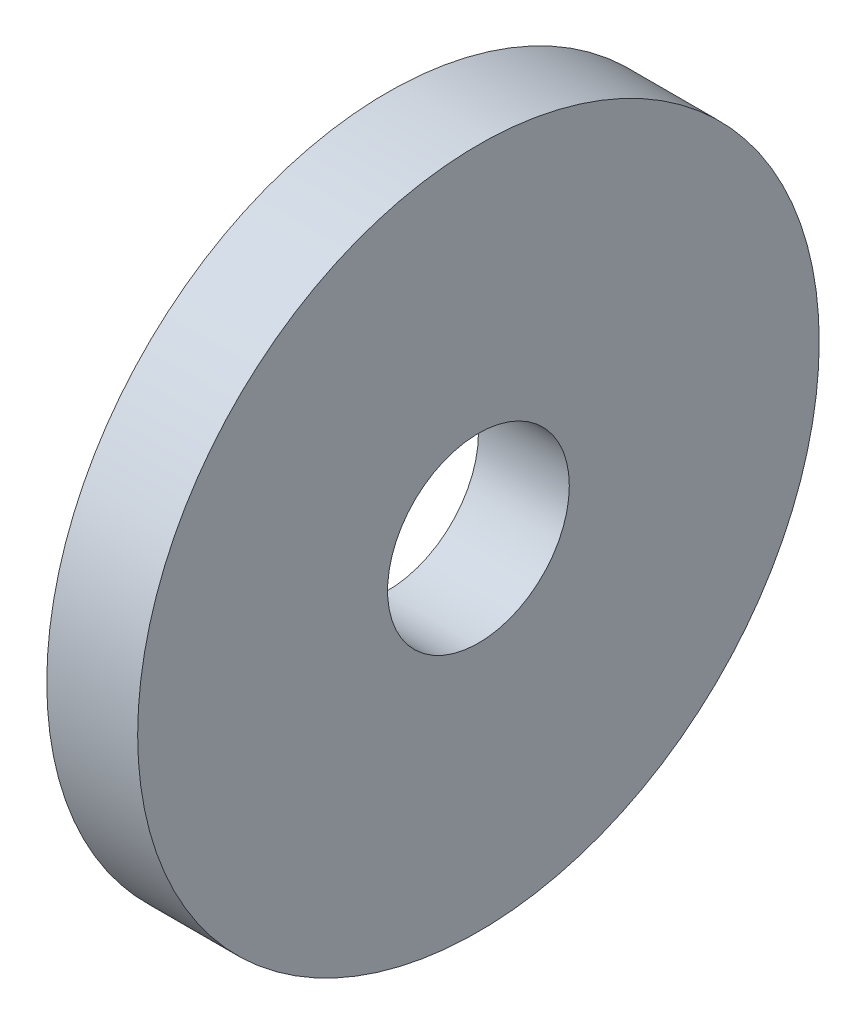
ISO-10303-21;
HEADER;
FILE_DESCRIPTION(('STEP AP214'),'2;1');
FILE_NAME('part.step','',(''),(''),'','','');
FILE_SCHEMA(('AUTOMOTIVE_DESIGN { 1 0 10303 214 1 1 1 1 }'));
ENDSEC;
DATA;
#1=APPLICATION_CONTEXT('core data for automotive mechanical design processes');
#2=APPLICATION_PROTOCOL_DEFINITION('international standard','automotive_design',2000,#1);
#3=PRODUCT_CONTEXT('',#1,'mechanical');
#4=PRODUCT('Part','Part','',(#3));
#5=PRODUCT_RELATED_PRODUCT_CATEGORY('part','',(#4));
#6=PRODUCT_DEFINITION_FORMATION('','',#4);
#7=PRODUCT_DEFINITION_CONTEXT('part definition',#1,'design');
#8=PRODUCT_DEFINITION('design','',#6,#7);
#9=PRODUCT_DEFINITION_SHAPE('','',#8);
#10=(LENGTH_UNIT() NAMED_UNIT(*) SI_UNIT(.MILLI.,.METRE.));
#11=(NAMED_UNIT(*) PLANE_ANGLE_UNIT() SI_UNIT($,.RADIAN.));
#12=(NAMED_UNIT(*) SI_UNIT($,.STERADIAN.) SOLID_ANGLE_UNIT());
#13=UNCERTAINTY_MEASURE_WITH_UNIT(LENGTH_MEASURE(1.E-05),#10,'distance_accuracy_value','');
#14=(GEOMETRIC_REPRESENTATION_CONTEXT(3) GLOBAL_UNCERTAINTY_ASSIGNED_CONTEXT((#13)) GLOBAL_UNIT_ASSIGNED_CONTEXT((#10,
#11,#12)) REPRESENTATION_CONTEXT('',''));
#15=CARTESIAN_POINT('',(0.,0.,0.));
#16=DIRECTION('',(0.,0.,1.));
#17=DIRECTION('',(1.,0.,0.));
#18=AXIS2_PLACEMENT_3D('',#15,#16,#17);
#19=CARTESIAN_POINT('',(2.,0.,0.));
#20=DIRECTION('',(1.,0.,0.));
#21=DIRECTION('',(0.,0.,-1.));
#22=AXIS2_PLACEMENT_3D('',#19,#20,#21);
#23=PLANE('',#22);
#24=CARTESIAN_POINT('',(2.,0.,0.));
#25=DIRECTION('',(1.,0.,0.));
#26=DIRECTION('',(0.,0.,-1.));
#27=AXIS2_PLACEMENT_3D('',#24,#25,#26);
#28=CIRCLE('',#27,7.5);
#29=CARTESIAN_POINT('',(2.,0.,-7.5));
#30=VERTEX_POINT('',#29);
#31=EDGE_CURVE('E10',#30,#30,#28,.T.);
#32=ORIENTED_EDGE('',*,*,#31,.T.);
#33=EDGE_LOOP('',(#32));
#34=FACE_BOUND('',#33,.T.);
#35=CARTESIAN_POINT('',(2.,0.,0.));
#36=DIRECTION('',(1.,0.,0.));
#37=DIRECTION('',(0.,0.,-1.));
#38=AXIS2_PLACEMENT_3D('',#35,#36,#37);
#39=CIRCLE('',#38,2.);
#40=CARTESIAN_POINT('',(2.,0.,-2.));
#41=VERTEX_POINT('',#40);
#42=EDGE_CURVE('E54',#41,#41,#39,.T.);
#43=ORIENTED_EDGE('',*,*,#42,.F.);
#44=EDGE_LOOP('',(#43));
#45=FACE_BOUND('',#44,.T.);
#46=ADVANCED_FACE('F41',(#34,#45),#23,.T.);
#47=CARTESIAN_POINT('',(0.,0.,0.));
#48=DIRECTION('',(1.,0.,0.));
#49=DIRECTION('',(0.,0.,-1.));
#50=AXIS2_PLACEMENT_3D('',#47,#48,#49);
#51=PLANE('',#50);
#52=CARTESIAN_POINT('',(0.,0.,0.));
#53=DIRECTION('',(1.,0.,0.));
#54=DIRECTION('',(0.,0.,-1.));
#55=AXIS2_PLACEMENT_3D('',#52,#53,#54);
#56=CIRCLE('',#55,7.5);
#57=CARTESIAN_POINT('',(0.,0.,-7.5));
#58=VERTEX_POINT('',#57);
#59=EDGE_CURVE('E45',#58,#58,#56,.T.);
#60=ORIENTED_EDGE('',*,*,#59,.F.);
#61=EDGE_LOOP('',(#60));
#62=FACE_BOUND('',#61,.T.);
#63=CARTESIAN_POINT('',(0.,0.,0.));
#64=DIRECTION('',(1.,0.,0.));
#65=DIRECTION('',(0.,0.,-1.));
#66=AXIS2_PLACEMENT_3D('',#63,#64,#65);
#67=CIRCLE('',#66,2.);
#68=CARTESIAN_POINT('',(0.,0.,-2.));
#69=VERTEX_POINT('',#68);
#70=EDGE_CURVE('E56',#69,#69,#67,.T.);
#71=ORIENTED_EDGE('',*,*,#70,.T.);
#72=EDGE_LOOP('',(#71));
#73=FACE_BOUND('',#72,.T.);
#74=ADVANCED_FACE('F68',(#62,#73),#51,.F.);
#75=CARTESIAN_POINT('',(2.,0.,0.));
#76=DIRECTION('',(-1.,0.,0.));
#77=DIRECTION('',(0.,0.,1.));
#78=AXIS2_PLACEMENT_3D('',#75,#76,#77);
#79=CYLINDRICAL_SURFACE('',#78,7.5);
#80=ORIENTED_EDGE('',*,*,#31,.F.);
#81=EDGE_LOOP('',(#80));
#82=FACE_BOUND('',#81,.T.);
#83=ORIENTED_EDGE('',*,*,#59,.T.);
#84=EDGE_LOOP('',(#83));
#85=FACE_BOUND('',#84,.T.);
#86=ADVANCED_FACE('F43',(#82,#85),#79,.T.);
#87=CARTESIAN_POINT('',(2.,0.,0.));
#88=DIRECTION('',(-1.,0.,0.));
#89=DIRECTION('',(0.,0.,1.));
#90=AXIS2_PLACEMENT_3D('',#87,#88,#89);
#91=CYLINDRICAL_SURFACE('',#90,2.);
#92=ORIENTED_EDGE('',*,*,#42,.T.);
#93=EDGE_LOOP('',(#92));
#94=FACE_BOUND('',#93,.T.);
#95=ORIENTED_EDGE('',*,*,#70,.F.);
#96=EDGE_LOOP('',(#95));
#97=FACE_BOUND('',#96,.T.);
#98=ADVANCED_FACE('F64',(#94,#97),#91,.F.);
#99=CLOSED_SHELL('',(#46,#74,#86,#98));
#100=MANIFOLD_SOLID_BREP('B2',#99);
#101=ADVANCED_BREP_SHAPE_REPRESENTATION('',(#18,#100),#14);
#102=SHAPE_DEFINITION_REPRESENTATION(#9,#101);
ENDSEC;
END-ISO-10303-21;
